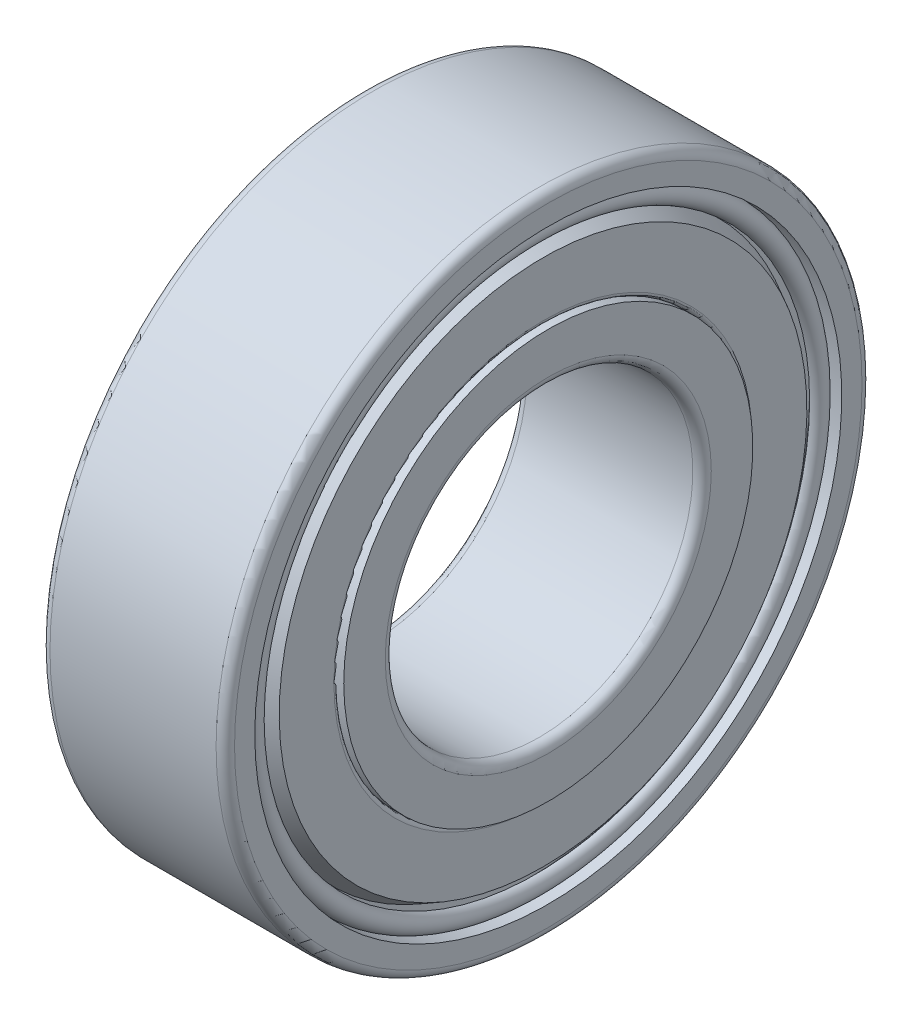
ISO-10303-21;
HEADER;
FILE_DESCRIPTION(('STEP AP214'),'2;1');
FILE_NAME('part.step','',(''),(''),'','','');
FILE_SCHEMA(('AUTOMOTIVE_DESIGN { 1 0 10303 214 1 1 1 1 }'));
ENDSEC;
DATA;
#1=APPLICATION_CONTEXT('core data for automotive mechanical design processes');
#2=APPLICATION_PROTOCOL_DEFINITION('international standard','automotive_design',2000,#1);
#3=PRODUCT_CONTEXT('',#1,'mechanical');
#4=PRODUCT('Part','Part','',(#3));
#5=PRODUCT_RELATED_PRODUCT_CATEGORY('part','',(#4));
#6=PRODUCT_DEFINITION_FORMATION('','',#4);
#7=PRODUCT_DEFINITION_CONTEXT('part definition',#1,'design');
#8=PRODUCT_DEFINITION('design','',#6,#7);
#9=PRODUCT_DEFINITION_SHAPE('','',#8);
#10=(LENGTH_UNIT() NAMED_UNIT(*) SI_UNIT(.MILLI.,.METRE.));
#11=(NAMED_UNIT(*) PLANE_ANGLE_UNIT() SI_UNIT($,.RADIAN.));
#12=(NAMED_UNIT(*) SI_UNIT($,.STERADIAN.) SOLID_ANGLE_UNIT());
#13=UNCERTAINTY_MEASURE_WITH_UNIT(LENGTH_MEASURE(1.E-05),#10,'distance_accuracy_value','');
#14=(GEOMETRIC_REPRESENTATION_CONTEXT(3) GLOBAL_UNCERTAINTY_ASSIGNED_CONTEXT((#13)) GLOBAL_UNIT_ASSIGNED_CONTEXT((#10,
#11,#12)) REPRESENTATION_CONTEXT('',''));
#15=CARTESIAN_POINT('',(0.,0.,0.));
#16=DIRECTION('',(0.,0.,1.));
#17=DIRECTION('',(1.,0.,0.));
#18=AXIS2_PLACEMENT_3D('',#15,#16,#17);
#19=CARTESIAN_POINT('',(10.36,0.,0.));
#20=DIRECTION('',(-1.,0.,0.));
#21=DIRECTION('',(0.,-1.,0.));
#22=AXIS2_PLACEMENT_3D('',#19,#20,#21);
#23=CONICAL_SURFACE('',#22,17.6352044884953,0.488692190558413);
#24=CARTESIAN_POINT('',(10.36,0.,0.));
#25=DIRECTION('',(-1.,0.,0.));
#26=DIRECTION('',(0.,-1.,0.));
#27=AXIS2_PLACEMENT_3D('',#24,#25,#26);
#28=CIRCLE('',#27,17.6352044884953);
#29=CARTESIAN_POINT('',(10.36,-17.6352044884953,0.));
#30=VERTEX_POINT('',#29);
#31=EDGE_CURVE('P0_E56',#30,#30,#28,.F.);
#32=ORIENTED_EDGE('',*,*,#31,.F.);
#33=EDGE_LOOP('',(#32));
#34=FACE_BOUND('',#33,.T.);
#35=CARTESIAN_POINT('',(11.46,0.,0.));
#36=DIRECTION('',(-1.,0.,0.));
#37=DIRECTION('',(0.,-1.,0.));
#38=AXIS2_PLACEMENT_3D('',#35,#36,#37);
#39=CIRCLE('',#38,17.0503241136677);
#40=CARTESIAN_POINT('',(11.46,-17.0503241136677,0.));
#41=VERTEX_POINT('',#40);
#42=EDGE_CURVE('P0_E53',#41,#41,#39,.T.);
#43=ORIENTED_EDGE('',*,*,#42,.F.);
#44=EDGE_LOOP('',(#43));
#45=FACE_BOUND('',#44,.T.);
#46=ADVANCED_FACE('P0_F15',(#34,#45),#23,.F.);
#47=CARTESIAN_POINT('',(10.36,0.,-18.0351017442477));
#48=DIRECTION('',(-1.,0.,0.));
#49=DIRECTION('',(0.,0.,1.));
#50=AXIS2_PLACEMENT_3D('',#47,#48,#49);
#51=PLANE('',#50);
#52=ORIENTED_EDGE('',*,*,#31,.T.);
#53=EDGE_LOOP('',(#52));
#54=FACE_BOUND('',#53,.T.);
#55=CARTESIAN_POINT('',(10.36,0.,0.));
#56=DIRECTION('',(-1.,0.,0.));
#57=DIRECTION('',(0.,-1.,0.));
#58=AXIS2_PLACEMENT_3D('',#55,#56,#57);
#59=CIRCLE('',#58,18.4349989999998);
#60=CARTESIAN_POINT('',(10.36,-18.4349989999998,0.));
#61=VERTEX_POINT('',#60);
#62=EDGE_CURVE('P0_E49',#61,#61,#59,.F.);
#63=ORIENTED_EDGE('',*,*,#62,.F.);
#64=EDGE_LOOP('',(#63));
#65=FACE_BOUND('',#64,.T.);
#66=ADVANCED_FACE('P0_F60',(#54,#65),#51,.T.);
#67=CARTESIAN_POINT('',(11.46,0.,-15.3251620568339));
#68=DIRECTION('',(-1.,0.,0.));
#69=DIRECTION('',(0.,-1.,0.));
#70=AXIS2_PLACEMENT_3D('',#67,#68,#69);
#71=PLANE('',#70);
#72=CARTESIAN_POINT('',(11.46,0.,0.));
#73=DIRECTION('',(-1.,0.,0.));
#74=DIRECTION('',(0.,0.,-1.));
#75=AXIS2_PLACEMENT_3D('',#72,#73,#74);
#76=CIRCLE('',#75,13.6);
#77=CARTESIAN_POINT('',(11.46,0.,-13.6));
#78=VERTEX_POINT('',#77);
#79=EDGE_CURVE('P0_E52',#78,#78,#76,.F.);
#80=ORIENTED_EDGE('',*,*,#79,.T.);
#81=EDGE_LOOP('',(#80));
#82=FACE_BOUND('',#81,.T.);
#83=ORIENTED_EDGE('',*,*,#42,.T.);
#84=EDGE_LOOP('',(#83));
#85=FACE_BOUND('',#84,.T.);
#86=ADVANCED_FACE('P0_F67',(#82,#85),#71,.T.);
#87=CARTESIAN_POINT('',(11.01,0.,0.));
#88=DIRECTION('',(-1.,0.,0.));
#89=DIRECTION('',(0.,1.,0.));
#90=AXIS2_PLACEMENT_3D('',#87,#88,#89);
#91=TOROIDAL_SURFACE('',#90,18.4042297692308,0.650727858295716);
#92=CARTESIAN_POINT('',(11.21,0.,0.));
#93=DIRECTION('',(-1.,0.,0.));
#94=DIRECTION('',(0.,0.,-1.));
#95=AXIS2_PLACEMENT_3D('',#92,#93,#94);
#96=CIRCLE('',#95,17.784999);
#97=CARTESIAN_POINT('',(11.21,0.,-17.784999));
#98=VERTEX_POINT('',#97);
#99=EDGE_CURVE('P0_E154',#98,#98,#96,.T.);
#100=ORIENTED_EDGE('',*,*,#99,.T.);
#101=EDGE_LOOP('',(#100));
#102=FACE_BOUND('',#101,.T.);
#103=ORIENTED_EDGE('',*,*,#62,.T.);
#104=EDGE_LOOP('',(#103));
#105=FACE_BOUND('',#104,.T.);
#106=ADVANCED_FACE('P0_F69',(#102,#105),#91,.T.);
#107=CARTESIAN_POINT('',(11.36,0.,0.));
#108=DIRECTION('',(-1.,0.,0.));
#109=DIRECTION('',(0.,1.,0.));
#110=AXIS2_PLACEMENT_3D('',#107,#108,#109);
#111=TOROIDAL_SURFACE('',#110,13.6,0.0999999999999996);
#112=ORIENTED_EDGE('',*,*,#79,.F.);
#113=EDGE_LOOP('',(#112));
#114=FACE_BOUND('',#113,.T.);
#115=CARTESIAN_POINT('',(11.36,0.,0.));
#116=DIRECTION('',(1.,0.,0.));
#117=DIRECTION('',(0.,1.,0.));
#118=AXIS2_PLACEMENT_3D('',#115,#116,#117);
#119=CIRCLE('',#118,13.5);
#120=CARTESIAN_POINT('',(11.36,13.5,0.));
#121=VERTEX_POINT('',#120);
#122=EDGE_CURVE('P0_E162',#121,#121,#119,.F.);
#123=ORIENTED_EDGE('',*,*,#122,.F.);
#124=EDGE_LOOP('',(#123));
#125=FACE_BOUND('',#124,.T.);
#126=ADVANCED_FACE('P0_F77',(#114,#125),#111,.F.);
#127=CARTESIAN_POINT('',(11.01,0.,0.));
#128=DIRECTION('',(-1.,0.,0.));
#129=DIRECTION('',(0.,-1.,0.));
#130=AXIS2_PLACEMENT_3D('',#127,#128,#129);
#131=CONICAL_SURFACE('',#130,17.984999,0.785398163397444);
#132=CARTESIAN_POINT('',(11.01,0.,0.));
#133=DIRECTION('',(-1.,0.,0.));
#134=DIRECTION('',(0.,1.,0.));
#135=AXIS2_PLACEMENT_3D('',#132,#133,#134);
#136=CIRCLE('',#135,17.984999);
#137=CARTESIAN_POINT('',(11.01,17.984999,0.));
#138=VERTEX_POINT('',#137);
#139=EDGE_CURVE('P0_E48',#138,#138,#136,.T.);
#140=ORIENTED_EDGE('',*,*,#139,.T.);
#141=EDGE_LOOP('',(#140));
#142=FACE_BOUND('',#141,.T.);
#143=ORIENTED_EDGE('',*,*,#99,.F.);
#144=EDGE_LOOP('',(#143));
#145=FACE_BOUND('',#144,.T.);
#146=ADVANCED_FACE('P0_F171',(#142,#145),#131,.F.);
#147=CARTESIAN_POINT('',(11.11,0.,0.));
#148=DIRECTION('',(1.,0.,0.));
#149=DIRECTION('',(0.,1.,0.));
#150=AXIS2_PLACEMENT_3D('',#147,#148,#149);
#151=CYLINDRICAL_SURFACE('',#150,13.5);
#152=ORIENTED_EDGE('',*,*,#122,.T.);
#153=EDGE_LOOP('',(#152));
#154=FACE_BOUND('',#153,.T.);
#155=CARTESIAN_POINT('',(10.86,0.,0.));
#156=DIRECTION('',(1.,0.,0.));
#157=DIRECTION('',(0.,1.,0.));
#158=AXIS2_PLACEMENT_3D('',#155,#156,#157);
#159=CIRCLE('',#158,13.5);
#160=CARTESIAN_POINT('',(10.86,13.5,0.));
#161=VERTEX_POINT('',#160);
#162=EDGE_CURVE('P0_E45',#161,#161,#159,.F.);
#163=ORIENTED_EDGE('',*,*,#162,.F.);
#164=EDGE_LOOP('',(#163));
#165=FACE_BOUND('',#164,.T.);
#166=ADVANCED_FACE('P0_F146',(#154,#165),#151,.T.);
#167=CARTESIAN_POINT('',(11.01,0.,0.));
#168=DIRECTION('',(-1.,0.,0.));
#169=DIRECTION('',(0.,1.,0.));
#170=AXIS2_PLACEMENT_3D('',#167,#168,#169);
#171=TOROIDAL_SURFACE('',#170,18.434999,0.449999999999997);
#172=CARTESIAN_POINT('',(10.56,0.,0.));
#173=DIRECTION('',(-1.,0.,0.));
#174=DIRECTION('',(0.,-1.,0.));
#175=AXIS2_PLACEMENT_3D('',#172,#173,#174);
#176=CIRCLE('',#175,18.434999);
#177=CARTESIAN_POINT('',(10.56,-18.434999,0.));
#178=VERTEX_POINT('',#177);
#179=EDGE_CURVE('P0_E44',#178,#178,#176,.F.);
#180=ORIENTED_EDGE('',*,*,#179,.F.);
#181=EDGE_LOOP('',(#180));
#182=FACE_BOUND('',#181,.T.);
#183=ORIENTED_EDGE('',*,*,#139,.F.);
#184=EDGE_LOOP('',(#183));
#185=FACE_BOUND('',#184,.T.);
#186=ADVANCED_FACE('P0_F141',(#182,#185),#171,.F.);
#187=CARTESIAN_POINT('',(10.86,0.,-13.4));
#188=DIRECTION('',(-1.,0.,0.));
#189=DIRECTION('',(0.,0.,1.));
#190=AXIS2_PLACEMENT_3D('',#187,#188,#189);
#191=PLANE('',#190);
#192=CARTESIAN_POINT('',(10.86,0.,0.));
#193=DIRECTION('',(1.,0.,0.));
#194=DIRECTION('',(0.,1.,0.));
#195=AXIS2_PLACEMENT_3D('',#192,#193,#194);
#196=CIRCLE('',#195,13.3);
#197=CARTESIAN_POINT('',(10.86,13.3,0.));
#198=VERTEX_POINT('',#197);
#199=EDGE_CURVE('P0_E41',#198,#198,#196,.T.);
#200=ORIENTED_EDGE('',*,*,#199,.T.);
#201=EDGE_LOOP('',(#200));
#202=FACE_BOUND('',#201,.T.);
#203=ORIENTED_EDGE('',*,*,#162,.T.);
#204=EDGE_LOOP('',(#203));
#205=FACE_BOUND('',#204,.T.);
#206=ADVANCED_FACE('P0_F137',(#202,#205),#191,.T.);
#207=CARTESIAN_POINT('',(10.56,0.,-18.0882726874138));
#208=DIRECTION('',(1.,0.,0.));
#209=DIRECTION('',(0.,1.,0.));
#210=AXIS2_PLACEMENT_3D('',#207,#208,#209);
#211=PLANE('',#210);
#212=CARTESIAN_POINT('',(10.56,0.,0.));
#213=DIRECTION('',(-1.,0.,0.));
#214=DIRECTION('',(0.,-1.,0.));
#215=AXIS2_PLACEMENT_3D('',#212,#213,#214);
#216=CIRCLE('',#215,17.7415463748276);
#217=CARTESIAN_POINT('',(10.56,-17.7415463748276,0.));
#218=VERTEX_POINT('',#217);
#219=EDGE_CURVE('P0_E32',#218,#218,#216,.F.);
#220=ORIENTED_EDGE('',*,*,#219,.F.);
#221=EDGE_LOOP('',(#220));
#222=FACE_BOUND('',#221,.T.);
#223=ORIENTED_EDGE('',*,*,#179,.T.);
#224=EDGE_LOOP('',(#223));
#225=FACE_BOUND('',#224,.T.);
#226=ADVANCED_FACE('P0_F126',(#222,#225),#211,.T.);
#227=CARTESIAN_POINT('',(11.11,0.,0.));
#228=DIRECTION('',(1.,0.,0.));
#229=DIRECTION('',(0.,1.,0.));
#230=AXIS2_PLACEMENT_3D('',#227,#228,#229);
#231=CYLINDRICAL_SURFACE('',#230,13.3);
#232=ORIENTED_EDGE('',*,*,#199,.F.);
#233=EDGE_LOOP('',(#232));
#234=FACE_BOUND('',#233,.T.);
#235=CARTESIAN_POINT('',(11.36,0.,0.));
#236=DIRECTION('',(-1.,0.,0.));
#237=DIRECTION('',(0.,1.,0.));
#238=AXIS2_PLACEMENT_3D('',#235,#236,#237);
#239=CIRCLE('',#238,13.3);
#240=CARTESIAN_POINT('',(11.36,13.3,0.));
#241=VERTEX_POINT('',#240);
#242=EDGE_CURVE('P0_E27',#241,#241,#239,.T.);
#243=ORIENTED_EDGE('',*,*,#242,.F.);
#244=EDGE_LOOP('',(#243));
#245=FACE_BOUND('',#244,.T.);
#246=ADVANCED_FACE('P0_F136',(#234,#245),#231,.F.);
#247=CARTESIAN_POINT('',(10.56,0.,0.));
#248=DIRECTION('',(-1.,0.,0.));
#249=DIRECTION('',(0.,-1.,0.));
#250=AXIS2_PLACEMENT_3D('',#247,#248,#249);
#251=CONICAL_SURFACE('',#250,17.7415463748276,0.488692190558412);
#252=CARTESIAN_POINT('',(11.66,0.,0.));
#253=DIRECTION('',(-1.,0.,0.));
#254=DIRECTION('',(0.,-1.,0.));
#255=AXIS2_PLACEMENT_3D('',#252,#253,#254);
#256=CIRCLE('',#255,17.156666);
#257=CARTESIAN_POINT('',(11.66,-17.156666,0.));
#258=VERTEX_POINT('',#257);
#259=EDGE_CURVE('P0_E22',#258,#258,#256,.F.);
#260=ORIENTED_EDGE('',*,*,#259,.F.);
#261=EDGE_LOOP('',(#260));
#262=FACE_BOUND('',#261,.T.);
#263=ORIENTED_EDGE('',*,*,#219,.T.);
#264=EDGE_LOOP('',(#263));
#265=FACE_BOUND('',#264,.T.);
#266=ADVANCED_FACE('P0_F89',(#262,#265),#251,.T.);
#267=CARTESIAN_POINT('',(11.36,0.,0.));
#268=DIRECTION('',(-1.,0.,0.));
#269=DIRECTION('',(0.,1.,0.));
#270=AXIS2_PLACEMENT_3D('',#267,#268,#269);
#271=TOROIDAL_SURFACE('',#270,13.6,0.299999999999999);
#272=ORIENTED_EDGE('',*,*,#242,.T.);
#273=EDGE_LOOP('',(#272));
#274=FACE_BOUND('',#273,.T.);
#275=CARTESIAN_POINT('',(11.66,0.,0.));
#276=DIRECTION('',(1.,0.,0.));
#277=DIRECTION('',(0.,0.,-1.));
#278=AXIS2_PLACEMENT_3D('',#275,#276,#277);
#279=CIRCLE('',#278,13.6);
#280=CARTESIAN_POINT('',(11.66,0.,-13.6));
#281=VERTEX_POINT('',#280);
#282=EDGE_CURVE('P0_E10',#281,#281,#279,.F.);
#283=ORIENTED_EDGE('',*,*,#282,.F.);
#284=EDGE_LOOP('',(#283));
#285=FACE_BOUND('',#284,.T.);
#286=ADVANCED_FACE('P0_F84',(#274,#285),#271,.T.);
#287=CARTESIAN_POINT('',(11.66,0.,-15.378333));
#288=DIRECTION('',(1.,0.,0.));
#289=DIRECTION('',(0.,0.,-1.));
#290=AXIS2_PLACEMENT_3D('',#287,#288,#289);
#291=PLANE('',#290);
#292=ORIENTED_EDGE('',*,*,#282,.T.);
#293=EDGE_LOOP('',(#292));
#294=FACE_BOUND('',#293,.T.);
#295=ORIENTED_EDGE('',*,*,#259,.T.);
#296=EDGE_LOOP('',(#295));
#297=FACE_BOUND('',#296,.T.);
#298=ADVANCED_FACE('P0_F82',(#294,#297),#291,.T.);
#299=CLOSED_SHELL('',(#46,#66,#86,#106,#126,#146,#166,#186,#206,#226,#246,#266,#286,#298));
#300=MANIFOLD_SOLID_BREP('P0_B1',#299);
#301=CARTESIAN_POINT('',(1.64,0.,0.));
#302=DIRECTION('',(1.,0.,0.));
#303=DIRECTION('',(0.,1.,0.));
#304=AXIS2_PLACEMENT_3D('',#301,#302,#303);
#305=CONICAL_SURFACE('',#304,17.6352044884953,0.488692190558413);
#306=CARTESIAN_POINT('',(1.64,0.,0.));
#307=DIRECTION('',(1.,0.,0.));
#308=DIRECTION('',(0.,1.,0.));
#309=AXIS2_PLACEMENT_3D('',#306,#307,#308);
#310=CIRCLE('',#309,17.6352044884953);
#311=CARTESIAN_POINT('',(1.64,17.6352044884953,0.));
#312=VERTEX_POINT('',#311);
#313=EDGE_CURVE('P1_E56',#312,#312,#310,.F.);
#314=ORIENTED_EDGE('',*,*,#313,.F.);
#315=EDGE_LOOP('',(#314));
#316=FACE_BOUND('',#315,.T.);
#317=CARTESIAN_POINT('',(0.540000000000006,0.,0.));
#318=DIRECTION('',(1.,0.,0.));
#319=DIRECTION('',(0.,1.,0.));
#320=AXIS2_PLACEMENT_3D('',#317,#318,#319);
#321=CIRCLE('',#320,17.0503241136677);
#322=CARTESIAN_POINT('',(0.540000000000006,17.0503241136677,0.));
#323=VERTEX_POINT('',#322);
#324=EDGE_CURVE('P1_E53',#323,#323,#321,.T.);
#325=ORIENTED_EDGE('',*,*,#324,.F.);
#326=EDGE_LOOP('',(#325));
#327=FACE_BOUND('',#326,.T.);
#328=ADVANCED_FACE('P1_F15',(#316,#327),#305,.F.);
#329=CARTESIAN_POINT('',(1.64,0.,18.0351017442477));
#330=DIRECTION('',(1.,0.,0.));
#331=DIRECTION('',(0.,0.,-1.));
#332=AXIS2_PLACEMENT_3D('',#329,#330,#331);
#333=PLANE('',#332);
#334=ORIENTED_EDGE('',*,*,#313,.T.);
#335=EDGE_LOOP('',(#334));
#336=FACE_BOUND('',#335,.T.);
#337=CARTESIAN_POINT('',(1.64,0.,0.));
#338=DIRECTION('',(1.,0.,0.));
#339=DIRECTION('',(0.,0.,-1.));
#340=AXIS2_PLACEMENT_3D('',#337,#338,#339);
#341=CIRCLE('',#340,18.434999);
#342=CARTESIAN_POINT('',(1.64,0.,-18.434999));
#343=VERTEX_POINT('',#342);
#344=EDGE_CURVE('P1_E49',#343,#343,#341,.F.);
#345=ORIENTED_EDGE('',*,*,#344,.F.);
#346=EDGE_LOOP('',(#345));
#347=FACE_BOUND('',#346,.T.);
#348=ADVANCED_FACE('P1_F60',(#336,#347),#333,.T.);
#349=CARTESIAN_POINT('',(0.54,0.,15.3251620568339));
#350=DIRECTION('',(1.,0.,0.));
#351=DIRECTION('',(0.,0.,-1.));
#352=AXIS2_PLACEMENT_3D('',#349,#350,#351);
#353=PLANE('',#352);
#354=CARTESIAN_POINT('',(0.54,0.,0.));
#355=DIRECTION('',(1.,0.,0.));
#356=DIRECTION('',(0.,0.,1.));
#357=AXIS2_PLACEMENT_3D('',#354,#355,#356);
#358=CIRCLE('',#357,13.6);
#359=CARTESIAN_POINT('',(0.54,0.,13.6));
#360=VERTEX_POINT('',#359);
#361=EDGE_CURVE('P1_E52',#360,#360,#358,.F.);
#362=ORIENTED_EDGE('',*,*,#361,.T.);
#363=EDGE_LOOP('',(#362));
#364=FACE_BOUND('',#363,.T.);
#365=ORIENTED_EDGE('',*,*,#324,.T.);
#366=EDGE_LOOP('',(#365));
#367=FACE_BOUND('',#366,.T.);
#368=ADVANCED_FACE('P1_F67',(#364,#367),#353,.T.);
#369=CARTESIAN_POINT('',(0.990000000000001,0.,0.));
#370=DIRECTION('',(1.,0.,0.));
#371=DIRECTION('',(0.,1.,0.));
#372=AXIS2_PLACEMENT_3D('',#369,#370,#371);
#373=TOROIDAL_SURFACE('',#372,18.4042297692308,0.650727858295716);
#374=CARTESIAN_POINT('',(0.789999999999999,0.,0.));
#375=DIRECTION('',(1.,0.,0.));
#376=DIRECTION('',(0.,0.,1.));
#377=AXIS2_PLACEMENT_3D('',#374,#375,#376);
#378=CIRCLE('',#377,17.784999);
#379=CARTESIAN_POINT('',(0.789999999999998,0.,17.784999));
#380=VERTEX_POINT('',#379);
#381=EDGE_CURVE('P1_E154',#380,#380,#378,.T.);
#382=ORIENTED_EDGE('',*,*,#381,.T.);
#383=EDGE_LOOP('',(#382));
#384=FACE_BOUND('',#383,.T.);
#385=ORIENTED_EDGE('',*,*,#344,.T.);
#386=EDGE_LOOP('',(#385));
#387=FACE_BOUND('',#386,.T.);
#388=ADVANCED_FACE('P1_F69',(#384,#387),#373,.T.);
#389=CARTESIAN_POINT('',(0.64,0.,0.));
#390=DIRECTION('',(1.,0.,0.));
#391=DIRECTION('',(0.,1.,0.));
#392=AXIS2_PLACEMENT_3D('',#389,#390,#391);
#393=TOROIDAL_SURFACE('',#392,13.6,0.0999999999999996);
#394=ORIENTED_EDGE('',*,*,#361,.F.);
#395=EDGE_LOOP('',(#394));
#396=FACE_BOUND('',#395,.T.);
#397=CARTESIAN_POINT('',(0.64,0.,0.));
#398=DIRECTION('',(-1.,0.,0.));
#399=DIRECTION('',(0.,0.,1.));
#400=AXIS2_PLACEMENT_3D('',#397,#398,#399);
#401=CIRCLE('',#400,13.5);
#402=CARTESIAN_POINT('',(0.64,0.,13.5));
#403=VERTEX_POINT('',#402);
#404=EDGE_CURVE('P1_E162',#403,#403,#401,.F.);
#405=ORIENTED_EDGE('',*,*,#404,.F.);
#406=EDGE_LOOP('',(#405));
#407=FACE_BOUND('',#406,.T.);
#408=ADVANCED_FACE('P1_F77',(#396,#407),#393,.F.);
#409=CARTESIAN_POINT('',(0.989999999999999,0.,0.));
#410=DIRECTION('',(1.,0.,0.));
#411=DIRECTION('',(0.,0.,-1.));
#412=AXIS2_PLACEMENT_3D('',#409,#410,#411);
#413=CONICAL_SURFACE('',#412,17.984999,0.785398163397449);
#414=CARTESIAN_POINT('',(0.99,0.,0.));
#415=DIRECTION('',(1.,0.,0.));
#416=DIRECTION('',(0.,1.,0.));
#417=AXIS2_PLACEMENT_3D('',#414,#415,#416);
#418=CIRCLE('',#417,17.984999);
#419=CARTESIAN_POINT('',(0.99,17.984999,0.));
#420=VERTEX_POINT('',#419);
#421=EDGE_CURVE('P1_E48',#420,#420,#418,.T.);
#422=ORIENTED_EDGE('',*,*,#421,.T.);
#423=EDGE_LOOP('',(#422));
#424=FACE_BOUND('',#423,.T.);
#425=ORIENTED_EDGE('',*,*,#381,.F.);
#426=EDGE_LOOP('',(#425));
#427=FACE_BOUND('',#426,.T.);
#428=ADVANCED_FACE('P1_F171',(#424,#427),#413,.F.);
#429=CARTESIAN_POINT('',(0.89,0.,0.));
#430=DIRECTION('',(-1.,0.,0.));
#431=DIRECTION('',(0.,0.,1.));
#432=AXIS2_PLACEMENT_3D('',#429,#430,#431);
#433=CYLINDRICAL_SURFACE('',#432,13.5);
#434=ORIENTED_EDGE('',*,*,#404,.T.);
#435=EDGE_LOOP('',(#434));
#436=FACE_BOUND('',#435,.T.);
#437=CARTESIAN_POINT('',(1.14,0.,0.));
#438=DIRECTION('',(-1.,0.,0.));
#439=DIRECTION('',(0.,0.,1.));
#440=AXIS2_PLACEMENT_3D('',#437,#438,#439);
#441=CIRCLE('',#440,13.5);
#442=CARTESIAN_POINT('',(1.14,0.,13.5));
#443=VERTEX_POINT('',#442);
#444=EDGE_CURVE('P1_E45',#443,#443,#441,.F.);
#445=ORIENTED_EDGE('',*,*,#444,.F.);
#446=EDGE_LOOP('',(#445));
#447=FACE_BOUND('',#446,.T.);
#448=ADVANCED_FACE('P1_F146',(#436,#447),#433,.T.);
#449=CARTESIAN_POINT('',(0.990000000000003,0.,0.));
#450=DIRECTION('',(1.,0.,0.));
#451=DIRECTION('',(0.,1.,0.));
#452=AXIS2_PLACEMENT_3D('',#449,#450,#451);
#453=TOROIDAL_SURFACE('',#452,18.434999,0.449999999999997);
#454=CARTESIAN_POINT('',(1.44,0.,0.));
#455=DIRECTION('',(1.,0.,0.));
#456=DIRECTION('',(0.,-1.,0.));
#457=AXIS2_PLACEMENT_3D('',#454,#455,#456);
#458=CIRCLE('',#457,18.434999);
#459=CARTESIAN_POINT('',(1.44,-18.434999,0.));
#460=VERTEX_POINT('',#459);
#461=EDGE_CURVE('P1_E44',#460,#460,#458,.F.);
#462=ORIENTED_EDGE('',*,*,#461,.F.);
#463=EDGE_LOOP('',(#462));
#464=FACE_BOUND('',#463,.T.);
#465=ORIENTED_EDGE('',*,*,#421,.F.);
#466=EDGE_LOOP('',(#465));
#467=FACE_BOUND('',#466,.T.);
#468=ADVANCED_FACE('P1_F141',(#464,#467),#453,.F.);
#469=CARTESIAN_POINT('',(1.14,0.,13.4));
#470=DIRECTION('',(1.,0.,0.));
#471=DIRECTION('',(0.,0.,-1.));
#472=AXIS2_PLACEMENT_3D('',#469,#470,#471);
#473=PLANE('',#472);
#474=CARTESIAN_POINT('',(1.14,0.,0.));
#475=DIRECTION('',(-1.,0.,0.));
#476=DIRECTION('',(0.,0.,1.));
#477=AXIS2_PLACEMENT_3D('',#474,#475,#476);
#478=CIRCLE('',#477,13.3);
#479=CARTESIAN_POINT('',(1.14,0.,13.3));
#480=VERTEX_POINT('',#479);
#481=EDGE_CURVE('P1_E41',#480,#480,#478,.T.);
#482=ORIENTED_EDGE('',*,*,#481,.T.);
#483=EDGE_LOOP('',(#482));
#484=FACE_BOUND('',#483,.T.);
#485=ORIENTED_EDGE('',*,*,#444,.T.);
#486=EDGE_LOOP('',(#485));
#487=FACE_BOUND('',#486,.T.);
#488=ADVANCED_FACE('P1_F137',(#484,#487),#473,.T.);
#489=CARTESIAN_POINT('',(1.44,0.,18.0882726874138));
#490=DIRECTION('',(-1.,0.,0.));
#491=DIRECTION('',(0.,0.,1.));
#492=AXIS2_PLACEMENT_3D('',#489,#490,#491);
#493=PLANE('',#492);
#494=CARTESIAN_POINT('',(1.43999999999999,0.,0.));
#495=DIRECTION('',(1.,0.,0.));
#496=DIRECTION('',(0.,0.,-1.));
#497=AXIS2_PLACEMENT_3D('',#494,#495,#496);
#498=CIRCLE('',#497,17.7415463748276);
#499=CARTESIAN_POINT('',(1.43999999999999,0.,-17.7415463748276));
#500=VERTEX_POINT('',#499);
#501=EDGE_CURVE('P1_E32',#500,#500,#498,.F.);
#502=ORIENTED_EDGE('',*,*,#501,.F.);
#503=EDGE_LOOP('',(#502));
#504=FACE_BOUND('',#503,.T.);
#505=ORIENTED_EDGE('',*,*,#461,.T.);
#506=EDGE_LOOP('',(#505));
#507=FACE_BOUND('',#506,.T.);
#508=ADVANCED_FACE('P1_F126',(#504,#507),#493,.T.);
#509=CARTESIAN_POINT('',(0.89,0.,0.));
#510=DIRECTION('',(-1.,0.,0.));
#511=DIRECTION('',(0.,0.,1.));
#512=AXIS2_PLACEMENT_3D('',#509,#510,#511);
#513=CYLINDRICAL_SURFACE('',#512,13.3);
#514=ORIENTED_EDGE('',*,*,#481,.F.);
#515=EDGE_LOOP('',(#514));
#516=FACE_BOUND('',#515,.T.);
#517=CARTESIAN_POINT('',(0.64,0.,0.));
#518=DIRECTION('',(1.,0.,0.));
#519=DIRECTION('',(0.,1.,0.));
#520=AXIS2_PLACEMENT_3D('',#517,#518,#519);
#521=CIRCLE('',#520,13.3);
#522=CARTESIAN_POINT('',(0.64,13.3,0.));
#523=VERTEX_POINT('',#522);
#524=EDGE_CURVE('P1_E27',#523,#523,#521,.T.);
#525=ORIENTED_EDGE('',*,*,#524,.F.);
#526=EDGE_LOOP('',(#525));
#527=FACE_BOUND('',#526,.T.);
#528=ADVANCED_FACE('P1_F136',(#516,#527),#513,.F.);
#529=CARTESIAN_POINT('',(1.43999999999999,0.,0.));
#530=DIRECTION('',(1.,0.,0.));
#531=DIRECTION('',(0.,0.,-1.));
#532=AXIS2_PLACEMENT_3D('',#529,#530,#531);
#533=CONICAL_SURFACE('',#532,17.7415463748276,0.488692190558413);
#534=CARTESIAN_POINT('',(0.340000000000007,0.,0.));
#535=DIRECTION('',(1.,0.,0.));
#536=DIRECTION('',(0.,0.,-1.));
#537=AXIS2_PLACEMENT_3D('',#534,#535,#536);
#538=CIRCLE('',#537,17.156666);
#539=CARTESIAN_POINT('',(0.340000000000007,0.,-17.156666));
#540=VERTEX_POINT('',#539);
#541=EDGE_CURVE('P1_E22',#540,#540,#538,.F.);
#542=ORIENTED_EDGE('',*,*,#541,.F.);
#543=EDGE_LOOP('',(#542));
#544=FACE_BOUND('',#543,.T.);
#545=ORIENTED_EDGE('',*,*,#501,.T.);
#546=EDGE_LOOP('',(#545));
#547=FACE_BOUND('',#546,.T.);
#548=ADVANCED_FACE('P1_F89',(#544,#547),#533,.T.);
#549=CARTESIAN_POINT('',(0.639999999999998,0.,0.));
#550=DIRECTION('',(1.,0.,0.));
#551=DIRECTION('',(0.,1.,0.));
#552=AXIS2_PLACEMENT_3D('',#549,#550,#551);
#553=TOROIDAL_SURFACE('',#552,13.6,0.299999999999999);
#554=ORIENTED_EDGE('',*,*,#524,.T.);
#555=EDGE_LOOP('',(#554));
#556=FACE_BOUND('',#555,.T.);
#557=CARTESIAN_POINT('',(0.339999999999999,0.,0.));
#558=DIRECTION('',(-1.,0.,0.));
#559=DIRECTION('',(0.,0.,1.));
#560=AXIS2_PLACEMENT_3D('',#557,#558,#559);
#561=CIRCLE('',#560,13.6);
#562=CARTESIAN_POINT('',(0.339999999999999,0.,13.6));
#563=VERTEX_POINT('',#562);
#564=EDGE_CURVE('P1_E10',#563,#563,#561,.F.);
#565=ORIENTED_EDGE('',*,*,#564,.F.);
#566=EDGE_LOOP('',(#565));
#567=FACE_BOUND('',#566,.T.);
#568=ADVANCED_FACE('P1_F84',(#556,#567),#553,.T.);
#569=CARTESIAN_POINT('',(0.34,0.,15.378333));
#570=DIRECTION('',(-1.,0.,0.));
#571=DIRECTION('',(0.,0.,1.));
#572=AXIS2_PLACEMENT_3D('',#569,#570,#571);
#573=PLANE('',#572);
#574=ORIENTED_EDGE('',*,*,#564,.T.);
#575=EDGE_LOOP('',(#574));
#576=FACE_BOUND('',#575,.T.);
#577=ORIENTED_EDGE('',*,*,#541,.T.);
#578=EDGE_LOOP('',(#577));
#579=FACE_BOUND('',#578,.T.);
#580=ADVANCED_FACE('P1_F82',(#576,#579),#573,.T.);
#581=CLOSED_SHELL('',(#328,#348,#368,#388,#408,#428,#448,#468,#488,#508,#528,#548,#568,#580));
#582=MANIFOLD_SOLID_BREP('P1_B1',#581);
#583=CARTESIAN_POINT('',(6.,11.9311422015781,-10.0114170208679));
#584=DIRECTION('',(0.57316594407899,0.804268306541565,0.156949965405551));
#585=DIRECTION('',(-0.610917125860704,0.291750056409459,0.735977017246581));
#586=AXIS2_PLACEMENT_3D('',#583,#584,#585);
#587=SPHERICAL_SURFACE('',#586,3.175);
#588=CARTESIAN_POINT('',(4.18019812754921,9.37759032830863,-10.5097331610305));
#589=VERTEX_POINT('',#588);
#590=VERTEX_LOOP('',#589);
#591=FACE_BOUND('',#590,.T.);
#592=CARTESIAN_POINT('',(7.81980187245079,14.4846940748476,-9.51310088070527));
#593=VERTEX_POINT('',#592);
#594=VERTEX_LOOP('',#593);
#595=FACE_BOUND('',#594,.T.);
#596=ADVANCED_FACE('P2_F16',(#591,#595),#587,.T.);
#597=CLOSED_SHELL('',(#596));
#598=MANIFOLD_SOLID_BREP('P2_B1',#597);
#599=CARTESIAN_POINT('',(6.,2.70457036716243,-15.3383807531651));
#600=DIRECTION('',(0.57316594407899,0.804268306541565,0.156949965405551));
#601=DIRECTION('',(-0.610917125860704,0.291750056409459,0.735977017246581));
#602=AXIS2_PLACEMENT_3D('',#599,#600,#601);
#603=SPHERICAL_SURFACE('',#602,3.175);
#604=CARTESIAN_POINT('',(4.18019812754921,0.151018493892962,-15.8366968933277));
#605=VERTEX_POINT('',#604);
#606=VERTEX_LOOP('',#605);
#607=FACE_BOUND('',#606,.T.);
#608=CARTESIAN_POINT('',(7.81980187245079,5.2581222404319,-14.8400646130025));
#609=VERTEX_POINT('',#608);
#610=VERTEX_LOOP('',#609);
#611=FACE_BOUND('',#610,.T.);
#612=ADVANCED_FACE('P3_F16',(#607,#611),#603,.T.);
#613=CLOSED_SHELL('',(#612));
#614=MANIFOLD_SOLID_BREP('P3_B1',#613);
#615=CARTESIAN_POINT('',(6.,-7.78750000000001,-13.4883456639426));
#616=DIRECTION('',(0.57316594407899,0.804268306541565,0.156949965405551));
#617=DIRECTION('',(-0.610917125860704,0.291750056409459,0.735977017246581));
#618=AXIS2_PLACEMENT_3D('',#615,#616,#617);
#619=SPHERICAL_SURFACE('',#618,3.175);
#620=CARTESIAN_POINT('',(4.18019812754921,-10.3410518732695,-13.9866618041052));
#621=VERTEX_POINT('',#620);
#622=VERTEX_LOOP('',#621);
#623=FACE_BOUND('',#622,.T.);
#624=CARTESIAN_POINT('',(7.81980187245079,-5.23394812673054,-12.99002952378));
#625=VERTEX_POINT('',#624);
#626=VERTEX_LOOP('',#625);
#627=FACE_BOUND('',#626,.T.);
#628=ADVANCED_FACE('P4_F16',(#623,#627),#619,.T.);
#629=CLOSED_SHELL('',(#628));
#630=MANIFOLD_SOLID_BREP('P4_B1',#629);
#631=CARTESIAN_POINT('',(6.,-14.6357125687405,-5.32696373229729));
#632=DIRECTION('',(0.57316594407899,0.804268306541565,0.156949965405551));
#633=DIRECTION('',(-0.610917125860704,0.291750056409459,0.735977017246581));
#634=AXIS2_PLACEMENT_3D('',#631,#632,#633);
#635=SPHERICAL_SURFACE('',#634,3.175);
#636=CARTESIAN_POINT('',(4.18019812754921,-17.18926444201,-5.82527987245991));
#637=VERTEX_POINT('',#636);
#638=VERTEX_LOOP('',#637);
#639=FACE_BOUND('',#638,.T.);
#640=CARTESIAN_POINT('',(7.81980187245079,-12.082160695471,-4.82864759213466));
#641=VERTEX_POINT('',#640);
#642=VERTEX_LOOP('',#641);
#643=FACE_BOUND('',#642,.T.);
#644=ADVANCED_FACE('P5_F16',(#639,#643),#635,.T.);
#645=CLOSED_SHELL('',(#644));
#646=MANIFOLD_SOLID_BREP('P5_B1',#645);
#647=CARTESIAN_POINT('',(6.,-14.6357125687405,5.32696373229729));
#648=DIRECTION('',(0.57316594407899,0.804268306541565,0.156949965405551));
#649=DIRECTION('',(-0.610917125860704,0.291750056409459,0.735977017246581));
#650=AXIS2_PLACEMENT_3D('',#647,#648,#649);
#651=SPHERICAL_SURFACE('',#650,3.175);
#652=CARTESIAN_POINT('',(7.81980187245079,-12.082160695471,5.82527987245992));
#653=VERTEX_POINT('',#652);
#654=VERTEX_LOOP('',#653);
#655=FACE_BOUND('',#654,.T.);
#656=CARTESIAN_POINT('',(4.18019812754921,-17.18926444201,4.82864759213466));
#657=VERTEX_POINT('',#656);
#658=VERTEX_LOOP('',#657);
#659=FACE_BOUND('',#658,.T.);
#660=ADVANCED_FACE('P6_F16',(#655,#659),#651,.T.);
#661=CLOSED_SHELL('',(#660));
#662=MANIFOLD_SOLID_BREP('P6_B1',#661);
#663=CARTESIAN_POINT('',(6.,-7.7875,13.4883456639426));
#664=DIRECTION('',(0.57316594407899,0.804268306541565,0.156949965405551));
#665=DIRECTION('',(-0.610917125860704,0.291750056409459,0.735977017246581));
#666=AXIS2_PLACEMENT_3D('',#663,#664,#665);
#667=SPHERICAL_SURFACE('',#666,3.175);
#668=CARTESIAN_POINT('',(7.81980187245079,-5.23394812673053,13.9866618041052));
#669=VERTEX_POINT('',#668);
#670=VERTEX_LOOP('',#669);
#671=FACE_BOUND('',#670,.T.);
#672=CARTESIAN_POINT('',(4.18019812754921,-10.3410518732695,12.99002952378));
#673=VERTEX_POINT('',#672);
#674=VERTEX_LOOP('',#673);
#675=FACE_BOUND('',#674,.T.);
#676=ADVANCED_FACE('P7_F16',(#671,#675),#667,.T.);
#677=CLOSED_SHELL('',(#676));
#678=MANIFOLD_SOLID_BREP('P7_B1',#677);
#679=CARTESIAN_POINT('',(6.,2.70457036716244,15.3383807531651));
#680=DIRECTION('',(0.57316594407899,0.804268306541565,0.156949965405551));
#681=DIRECTION('',(-0.610917125860704,0.291750056409459,0.735977017246581));
#682=AXIS2_PLACEMENT_3D('',#679,#680,#681);
#683=SPHERICAL_SURFACE('',#682,3.175);
#684=CARTESIAN_POINT('',(7.81980187245079,5.25812224043191,15.8366968933277));
#685=VERTEX_POINT('',#684);
#686=VERTEX_LOOP('',#685);
#687=FACE_BOUND('',#686,.T.);
#688=CARTESIAN_POINT('',(4.18019812754921,0.151018493892972,14.8400646130025));
#689=VERTEX_POINT('',#688);
#690=VERTEX_LOOP('',#689);
#691=FACE_BOUND('',#690,.T.);
#692=ADVANCED_FACE('P8_F16',(#687,#691),#683,.T.);
#693=CLOSED_SHELL('',(#692));
#694=MANIFOLD_SOLID_BREP('P8_B1',#693);
#695=CARTESIAN_POINT('',(6.,11.9311422015781,10.0114170208678));
#696=DIRECTION('',(0.59642475200704,0.504719422071691,0.624128047901198));
#697=DIRECTION('',(-0.283089198035408,-0.595332836908352,0.751956992955264));
#698=AXIS2_PLACEMENT_3D('',#695,#696,#697);
#699=SPHERICAL_SURFACE('',#698,3.175);
#700=CARTESIAN_POINT('',(7.89364858762235,13.5336263666557,11.9930235729541));
#701=VERTEX_POINT('',#700);
#702=VERTEX_LOOP('',#701);
#703=FACE_BOUND('',#702,.T.);
#704=CARTESIAN_POINT('',(4.10635141237765,10.3286580365005,8.0298104687815));
#705=VERTEX_POINT('',#704);
#706=VERTEX_LOOP('',#705);
#707=FACE_BOUND('',#706,.T.);
#708=ADVANCED_FACE('P9_F16',(#703,#707),#699,.T.);
#709=CLOSED_SHELL('',(#708));
#710=MANIFOLD_SOLID_BREP('P9_B1',#709);
#711=CARTESIAN_POINT('',(6.,15.575,0.));
#712=DIRECTION('',(0.59642475200704,0.504719422071691,0.624128047901198));
#713=DIRECTION('',(-0.283089198035408,-0.595332836908352,0.751956992955264));
#714=AXIS2_PLACEMENT_3D('',#711,#712,#713);
#715=SPHERICAL_SURFACE('',#714,3.175);
#716=CARTESIAN_POINT('',(4.10635141237765,13.9725158349224,-1.9816065520863));
#717=VERTEX_POINT('',#716);
#718=VERTEX_LOOP('',#717);
#719=FACE_BOUND('',#718,.T.);
#720=CARTESIAN_POINT('',(7.89364858762235,17.1774841650776,1.9816065520863));
#721=VERTEX_POINT('',#720);
#722=VERTEX_LOOP('',#721);
#723=FACE_BOUND('',#722,.T.);
#724=ADVANCED_FACE('P10_F16',(#719,#723),#715,.T.);
#725=CLOSED_SHELL('',(#724));
#726=MANIFOLD_SOLID_BREP('P10_B1',#725);
#727=CARTESIAN_POINT('',(6.,0.,0.));
#728=DIRECTION('',(1.,0.,0.));
#729=DIRECTION('',(0.,1.,0.));
#730=AXIS2_PLACEMENT_3D('',#727,#728,#729);
#731=TOROIDAL_SURFACE('',#730,15.5,3.175);
#732=CARTESIAN_POINT('',(8.2550826514786,0.,0.));
#733=DIRECTION('',(-1.,0.,0.));
#734=DIRECTION('',(0.,0.,1.));
#735=AXIS2_PLACEMENT_3D('',#732,#733,#734);
#736=CIRCLE('',#735,17.7350005);
#737=CARTESIAN_POINT('',(8.2550826514786,0.,17.7350005));
#738=VERTEX_POINT('',#737);
#739=EDGE_CURVE('P11_E140',#738,#738,#736,.F.);
#740=ORIENTED_EDGE('',*,*,#739,.T.);
#741=EDGE_LOOP('',(#740));
#742=FACE_BOUND('',#741,.T.);
#743=CARTESIAN_POINT('',(3.7449173485214,0.,0.));
#744=DIRECTION('',(-1.,0.,0.));
#745=DIRECTION('',(0.,0.,1.));
#746=AXIS2_PLACEMENT_3D('',#743,#744,#745);
#747=CIRCLE('',#746,17.7350005);
#748=CARTESIAN_POINT('',(3.7449173485214,0.,17.7350005));
#749=VERTEX_POINT('',#748);
#750=EDGE_CURVE('P11_E130',#749,#749,#747,.T.);
#751=ORIENTED_EDGE('',*,*,#750,.T.);
#752=EDGE_LOOP('',(#751));
#753=FACE_BOUND('',#752,.T.);
#754=ADVANCED_FACE('P11_F15',(#742,#753),#731,.F.);
#755=CARTESIAN_POINT('',(2.6924586742607,0.,0.));
#756=DIRECTION('',(-1.,0.,0.));
#757=DIRECTION('',(0.,0.,1.));
#758=AXIS2_PLACEMENT_3D('',#755,#756,#757);
#759=CYLINDRICAL_SURFACE('',#758,17.7350005);
#760=ORIENTED_EDGE('',*,*,#750,.F.);
#761=EDGE_LOOP('',(#760));
#762=FACE_BOUND('',#761,.T.);
#763=CARTESIAN_POINT('',(1.64,0.,0.));
#764=DIRECTION('',(-1.,0.,0.));
#765=DIRECTION('',(0.,0.,1.));
#766=AXIS2_PLACEMENT_3D('',#763,#764,#765);
#767=CIRCLE('',#766,17.7350005);
#768=CARTESIAN_POINT('',(1.64,0.,17.7350005));
#769=VERTEX_POINT('',#768);
#770=EDGE_CURVE('P11_E19',#769,#769,#767,.F.);
#771=ORIENTED_EDGE('',*,*,#770,.F.);
#772=EDGE_LOOP('',(#771));
#773=FACE_BOUND('',#772,.T.);
#774=ADVANCED_FACE('P11_F98',(#762,#773),#759,.F.);
#775=CARTESIAN_POINT('',(9.3075413257393,0.,0.));
#776=DIRECTION('',(-1.,0.,0.));
#777=DIRECTION('',(0.,0.,1.));
#778=AXIS2_PLACEMENT_3D('',#775,#776,#777);
#779=CYLINDRICAL_SURFACE('',#778,17.7350005);
#780=CARTESIAN_POINT('',(10.36,0.,0.));
#781=DIRECTION('',(-1.,0.,0.));
#782=DIRECTION('',(0.,0.,1.));
#783=AXIS2_PLACEMENT_3D('',#780,#781,#782);
#784=CIRCLE('',#783,17.7350005);
#785=CARTESIAN_POINT('',(10.36,0.,17.7350005));
#786=VERTEX_POINT('',#785);
#787=EDGE_CURVE('P11_E136',#786,#786,#784,.T.);
#788=ORIENTED_EDGE('',*,*,#787,.F.);
#789=EDGE_LOOP('',(#788));
#790=FACE_BOUND('',#789,.T.);
#791=ORIENTED_EDGE('',*,*,#739,.F.);
#792=EDGE_LOOP('',(#791));
#793=FACE_BOUND('',#792,.T.);
#794=ADVANCED_FACE('P11_F95',(#790,#793),#779,.F.);
#795=CARTESIAN_POINT('',(1.64,0.,18.40999975));
#796=DIRECTION('',(-1.,0.,0.));
#797=DIRECTION('',(0.,0.,1.));
#798=AXIS2_PLACEMENT_3D('',#795,#796,#797);
#799=PLANE('',#798);
#800=ORIENTED_EDGE('',*,*,#770,.T.);
#801=EDGE_LOOP('',(#800));
#802=FACE_BOUND('',#801,.T.);
#803=CARTESIAN_POINT('',(1.64,0.,0.));
#804=DIRECTION('',(-1.,0.,0.));
#805=DIRECTION('',(0.,0.,1.));
#806=AXIS2_PLACEMENT_3D('',#803,#804,#805);
#807=CIRCLE('',#806,19.084999);
#808=CARTESIAN_POINT('',(1.64,0.,19.084999));
#809=VERTEX_POINT('',#808);
#810=EDGE_CURVE('P11_E134',#809,#809,#807,.T.);
#811=ORIENTED_EDGE('',*,*,#810,.T.);
#812=EDGE_LOOP('',(#811));
#813=FACE_BOUND('',#812,.T.);
#814=ADVANCED_FACE('P11_F91',(#802,#813),#799,.T.);
#815=CARTESIAN_POINT('',(10.36,0.,18.40999975));
#816=DIRECTION('',(1.,0.,0.));
#817=DIRECTION('',(0.,0.,-1.));
#818=AXIS2_PLACEMENT_3D('',#815,#816,#817);
#819=PLANE('',#818);
#820=ORIENTED_EDGE('',*,*,#787,.T.);
#821=EDGE_LOOP('',(#820));
#822=FACE_BOUND('',#821,.T.);
#823=CARTESIAN_POINT('',(10.36,0.,0.));
#824=DIRECTION('',(-1.,0.,0.));
#825=DIRECTION('',(0.,0.,1.));
#826=AXIS2_PLACEMENT_3D('',#823,#824,#825);
#827=CIRCLE('',#826,19.084999);
#828=CARTESIAN_POINT('',(10.36,0.,19.084999));
#829=VERTEX_POINT('',#828);
#830=EDGE_CURVE('P11_E127',#829,#829,#827,.F.);
#831=ORIENTED_EDGE('',*,*,#830,.T.);
#832=EDGE_LOOP('',(#831));
#833=FACE_BOUND('',#832,.T.);
#834=ADVANCED_FACE('P11_F87',(#822,#833),#819,.T.);
#835=CARTESIAN_POINT('',(0.82,0.,0.));
#836=DIRECTION('',(-1.,0.,0.));
#837=DIRECTION('',(0.,0.,1.));
#838=AXIS2_PLACEMENT_3D('',#835,#836,#837);
#839=CYLINDRICAL_SURFACE('',#838,19.084999);
#840=ORIENTED_EDGE('',*,*,#810,.F.);
#841=EDGE_LOOP('',(#840));
#842=FACE_BOUND('',#841,.T.);
#843=CARTESIAN_POINT('',(0.,0.,0.));
#844=DIRECTION('',(-1.,0.,0.));
#845=DIRECTION('',(0.,0.,1.));
#846=AXIS2_PLACEMENT_3D('',#843,#844,#845);
#847=CIRCLE('',#846,19.084999);
#848=CARTESIAN_POINT('',(0.,0.,19.084999));
#849=VERTEX_POINT('',#848);
#850=EDGE_CURVE('P11_E123',#849,#849,#847,.F.);
#851=ORIENTED_EDGE('',*,*,#850,.F.);
#852=EDGE_LOOP('',(#851));
#853=FACE_BOUND('',#852,.T.);
#854=ADVANCED_FACE('P11_F83',(#842,#853),#839,.F.);
#855=CARTESIAN_POINT('',(11.18,0.,0.));
#856=DIRECTION('',(-1.,0.,0.));
#857=DIRECTION('',(0.,0.,1.));
#858=AXIS2_PLACEMENT_3D('',#855,#856,#857);
#859=CYLINDRICAL_SURFACE('',#858,19.084999);
#860=CARTESIAN_POINT('',(12.,0.,0.));
#861=DIRECTION('',(-1.,0.,0.));
#862=DIRECTION('',(0.,0.,1.));
#863=AXIS2_PLACEMENT_3D('',#860,#861,#862);
#864=CIRCLE('',#863,19.084999);
#865=CARTESIAN_POINT('',(12.,0.,19.084999));
#866=VERTEX_POINT('',#865);
#867=EDGE_CURVE('P11_E121',#866,#866,#864,.T.);
#868=ORIENTED_EDGE('',*,*,#867,.F.);
#869=EDGE_LOOP('',(#868));
#870=FACE_BOUND('',#869,.T.);
#871=ORIENTED_EDGE('',*,*,#830,.F.);
#872=EDGE_LOOP('',(#871));
#873=FACE_BOUND('',#872,.T.);
#874=ADVANCED_FACE('P11_F78',(#870,#873),#859,.F.);
#875=CARTESIAN_POINT('',(0.,0.,19.7424995));
#876=DIRECTION('',(-1.,0.,0.));
#877=DIRECTION('',(0.,0.,1.));
#878=AXIS2_PLACEMENT_3D('',#875,#876,#877);
#879=PLANE('',#878);
#880=ORIENTED_EDGE('',*,*,#850,.T.);
#881=EDGE_LOOP('',(#880));
#882=FACE_BOUND('',#881,.T.);
#883=CARTESIAN_POINT('',(0.,0.,0.));
#884=DIRECTION('',(1.,0.,0.));
#885=DIRECTION('',(0.,-1.,0.));
#886=AXIS2_PLACEMENT_3D('',#883,#884,#885);
#887=CIRCLE('',#886,20.4);
#888=CARTESIAN_POINT('',(0.,-20.4,0.));
#889=VERTEX_POINT('',#888);
#890=EDGE_CURVE('P11_E62',#889,#889,#887,.T.);
#891=ORIENTED_EDGE('',*,*,#890,.F.);
#892=EDGE_LOOP('',(#891));
#893=FACE_BOUND('',#892,.T.);
#894=ADVANCED_FACE('P11_F68',(#882,#893),#879,.T.);
#895=CARTESIAN_POINT('',(12.,0.,19.7424995));
#896=DIRECTION('',(1.,0.,0.));
#897=DIRECTION('',(0.,0.,-1.));
#898=AXIS2_PLACEMENT_3D('',#895,#896,#897);
#899=PLANE('',#898);
#900=ORIENTED_EDGE('',*,*,#867,.T.);
#901=EDGE_LOOP('',(#900));
#902=FACE_BOUND('',#901,.T.);
#903=CARTESIAN_POINT('',(12.,0.,0.));
#904=DIRECTION('',(-1.,0.,0.));
#905=DIRECTION('',(0.,-1.,0.));
#906=AXIS2_PLACEMENT_3D('',#903,#904,#905);
#907=CIRCLE('',#906,20.4);
#908=CARTESIAN_POINT('',(12.,-20.4,0.));
#909=VERTEX_POINT('',#908);
#910=EDGE_CURVE('P11_E28',#909,#909,#907,.T.);
#911=ORIENTED_EDGE('',*,*,#910,.F.);
#912=EDGE_LOOP('',(#911));
#913=FACE_BOUND('',#912,.T.);
#914=ADVANCED_FACE('P11_F77',(#902,#913),#899,.T.);
#915=CARTESIAN_POINT('',(0.599999999999998,0.,0.));
#916=DIRECTION('',(1.,0.,0.));
#917=DIRECTION('',(0.,1.,0.));
#918=AXIS2_PLACEMENT_3D('',#915,#916,#917);
#919=TOROIDAL_SURFACE('',#918,20.4,0.599999999999998);
#920=ORIENTED_EDGE('',*,*,#890,.T.);
#921=EDGE_LOOP('',(#920));
#922=FACE_BOUND('',#921,.T.);
#923=CARTESIAN_POINT('',(0.6,0.,0.));
#924=DIRECTION('',(-1.,0.,0.));
#925=DIRECTION('',(0.,0.,1.));
#926=AXIS2_PLACEMENT_3D('',#923,#924,#925);
#927=CIRCLE('',#926,21.);
#928=CARTESIAN_POINT('',(0.6,0.,21.));
#929=VERTEX_POINT('',#928);
#930=EDGE_CURVE('P11_E23',#929,#929,#927,.F.);
#931=ORIENTED_EDGE('',*,*,#930,.F.);
#932=EDGE_LOOP('',(#931));
#933=FACE_BOUND('',#932,.T.);
#934=ADVANCED_FACE('P11_F42',(#922,#933),#919,.T.);
#935=CARTESIAN_POINT('',(11.4,0.,0.));
#936=DIRECTION('',(1.,0.,0.));
#937=DIRECTION('',(0.,1.,0.));
#938=AXIS2_PLACEMENT_3D('',#935,#936,#937);
#939=TOROIDAL_SURFACE('',#938,20.4,0.600000000000001);
#940=CARTESIAN_POINT('',(11.4,0.,0.));
#941=DIRECTION('',(-1.,0.,0.));
#942=DIRECTION('',(0.,0.,1.));
#943=AXIS2_PLACEMENT_3D('',#940,#941,#942);
#944=CIRCLE('',#943,21.);
#945=CARTESIAN_POINT('',(11.4,0.,21.));
#946=VERTEX_POINT('',#945);
#947=EDGE_CURVE('P11_E10',#946,#946,#944,.T.);
#948=ORIENTED_EDGE('',*,*,#947,.F.);
#949=EDGE_LOOP('',(#948));
#950=FACE_BOUND('',#949,.T.);
#951=ORIENTED_EDGE('',*,*,#910,.T.);
#952=EDGE_LOOP('',(#951));
#953=FACE_BOUND('',#952,.T.);
#954=ADVANCED_FACE('P11_F36',(#950,#953),#939,.T.);
#955=CARTESIAN_POINT('',(6.,0.,0.));
#956=DIRECTION('',(-1.,0.,0.));
#957=DIRECTION('',(0.,0.,1.));
#958=AXIS2_PLACEMENT_3D('',#955,#956,#957);
#959=CYLINDRICAL_SURFACE('',#958,21.);
#960=ORIENTED_EDGE('',*,*,#930,.T.);
#961=EDGE_LOOP('',(#960));
#962=FACE_BOUND('',#961,.T.);
#963=ORIENTED_EDGE('',*,*,#947,.T.);
#964=EDGE_LOOP('',(#963));
#965=FACE_BOUND('',#964,.T.);
#966=ADVANCED_FACE('P11_F41',(#962,#965),#959,.T.);
#967=CLOSED_SHELL('',(#754,#774,#794,#814,#834,#854,#874,#894,#914,#934,#954,#966));
#968=MANIFOLD_SOLID_BREP('P11_B1',#967);
#969=CARTESIAN_POINT('',(6.,0.,0.));
#970=DIRECTION('',(-1.,0.,0.));
#971=DIRECTION('',(0.,0.,1.));
#972=AXIS2_PLACEMENT_3D('',#969,#970,#971);
#973=CYLINDRICAL_SURFACE('',#972,10.);
#974=CARTESIAN_POINT('',(0.6,0.,0.));
#975=DIRECTION('',(1.,0.,0.));
#976=DIRECTION('',(0.,1.,0.));
#977=AXIS2_PLACEMENT_3D('',#974,#975,#976);
#978=CIRCLE('',#977,10.);
#979=CARTESIAN_POINT('',(0.6,10.,0.));
#980=VERTEX_POINT('',#979);
#981=EDGE_CURVE('P12_E69',#980,#980,#978,.T.);
#982=ORIENTED_EDGE('',*,*,#981,.F.);
#983=EDGE_LOOP('',(#982));
#984=FACE_BOUND('',#983,.T.);
#985=CARTESIAN_POINT('',(11.4,0.,0.));
#986=DIRECTION('',(1.,0.,0.));
#987=DIRECTION('',(0.,1.,0.));
#988=AXIS2_PLACEMENT_3D('',#985,#986,#987);
#989=CIRCLE('',#988,10.);
#990=CARTESIAN_POINT('',(11.4,10.,0.));
#991=VERTEX_POINT('',#990);
#992=EDGE_CURVE('P12_E66',#991,#991,#989,.F.);
#993=ORIENTED_EDGE('',*,*,#992,.F.);
#994=EDGE_LOOP('',(#993));
#995=FACE_BOUND('',#994,.T.);
#996=ADVANCED_FACE('P12_F15',(#984,#995),#973,.F.);
#997=CARTESIAN_POINT('',(0.6,0.,0.));
#998=DIRECTION('',(1.,0.,0.));
#999=DIRECTION('',(0.,1.,0.));
#1000=AXIS2_PLACEMENT_3D('',#997,#998,#999);
#1001=TOROIDAL_SURFACE('',#1000,10.6,0.6);
#1002=ORIENTED_EDGE('',*,*,#981,.T.);
#1003=EDGE_LOOP('',(#1002));
#1004=FACE_BOUND('',#1003,.T.);
#1005=CARTESIAN_POINT('',(0.,0.,0.));
#1006=DIRECTION('',(-1.,0.,0.));
#1007=DIRECTION('',(0.,-1.,0.));
#1008=AXIS2_PLACEMENT_3D('',#1005,#1006,#1007);
#1009=CIRCLE('',#1008,10.6);
#1010=CARTESIAN_POINT('',(0.,-10.6,0.));
#1011=VERTEX_POINT('',#1010);
#1012=EDGE_CURVE('P12_E39',#1011,#1011,#1009,.F.);
#1013=ORIENTED_EDGE('',*,*,#1012,.F.);
#1014=EDGE_LOOP('',(#1013));
#1015=FACE_BOUND('',#1014,.T.);
#1016=ADVANCED_FACE('P12_F59',(#1004,#1015),#1001,.T.);
#1017=CARTESIAN_POINT('',(11.4,0.,0.));
#1018=DIRECTION('',(1.,0.,0.));
#1019=DIRECTION('',(0.,1.,0.));
#1020=AXIS2_PLACEMENT_3D('',#1017,#1018,#1019);
#1021=TOROIDAL_SURFACE('',#1020,10.6,0.600000000000001);
#1022=CARTESIAN_POINT('',(12.,0.,0.));
#1023=DIRECTION('',(1.,0.,0.));
#1024=DIRECTION('',(0.,-1.,0.));
#1025=AXIS2_PLACEMENT_3D('',#1022,#1023,#1024);
#1026=CIRCLE('',#1025,10.6);
#1027=CARTESIAN_POINT('',(12.,-10.6,0.));
#1028=VERTEX_POINT('',#1027);
#1029=EDGE_CURVE('P12_E72',#1028,#1028,#1026,.F.);
#1030=ORIENTED_EDGE('',*,*,#1029,.F.);
#1031=EDGE_LOOP('',(#1030));
#1032=FACE_BOUND('',#1031,.T.);
#1033=ORIENTED_EDGE('',*,*,#992,.T.);
#1034=EDGE_LOOP('',(#1033));
#1035=FACE_BOUND('',#1034,.T.);
#1036=ADVANCED_FACE('P12_F54',(#1032,#1035),#1021,.T.);
#1037=CARTESIAN_POINT('',(0.,0.,11.95));
#1038=DIRECTION('',(-1.,0.,0.));
#1039=DIRECTION('',(0.,0.,1.));
#1040=AXIS2_PLACEMENT_3D('',#1037,#1038,#1039);
#1041=PLANE('',#1040);
#1042=ORIENTED_EDGE('',*,*,#1012,.T.);
#1043=EDGE_LOOP('',(#1042));
#1044=FACE_BOUND('',#1043,.T.);
#1045=CARTESIAN_POINT('',(0.,0.,0.));
#1046=DIRECTION('',(-1.,0.,0.));
#1047=DIRECTION('',(0.,0.,1.));
#1048=AXIS2_PLACEMENT_3D('',#1045,#1046,#1047);
#1049=CIRCLE('',#1048,13.3);
#1050=CARTESIAN_POINT('',(0.,0.,13.3));
#1051=VERTEX_POINT('',#1050);
#1052=EDGE_CURVE('P12_E18',#1051,#1051,#1049,.F.);
#1053=ORIENTED_EDGE('',*,*,#1052,.F.);
#1054=EDGE_LOOP('',(#1053));
#1055=FACE_BOUND('',#1054,.T.);
#1056=ADVANCED_FACE('P12_F44',(#1044,#1055),#1041,.T.);
#1057=CARTESIAN_POINT('',(12.,0.,11.95));
#1058=DIRECTION('',(1.,0.,0.));
#1059=DIRECTION('',(0.,0.,-1.));
#1060=AXIS2_PLACEMENT_3D('',#1057,#1058,#1059);
#1061=PLANE('',#1060);
#1062=ORIENTED_EDGE('',*,*,#1029,.T.);
#1063=EDGE_LOOP('',(#1062));
#1064=FACE_BOUND('',#1063,.T.);
#1065=CARTESIAN_POINT('',(12.,0.,0.));
#1066=DIRECTION('',(-1.,0.,0.));
#1067=DIRECTION('',(0.,0.,1.));
#1068=AXIS2_PLACEMENT_3D('',#1065,#1066,#1067);
#1069=CIRCLE('',#1068,13.3);
#1070=CARTESIAN_POINT('',(12.,0.,13.3));
#1071=VERTEX_POINT('',#1070);
#1072=EDGE_CURVE('P12_E27',#1071,#1071,#1069,.T.);
#1073=ORIENTED_EDGE('',*,*,#1072,.F.);
#1074=EDGE_LOOP('',(#1073));
#1075=FACE_BOUND('',#1074,.T.);
#1076=ADVANCED_FACE('P12_F53',(#1064,#1075),#1061,.T.);
#1077=CARTESIAN_POINT('',(1.85537942967986,0.,0.));
#1078=DIRECTION('',(-1.,0.,0.));
#1079=DIRECTION('',(0.,0.,1.));
#1080=AXIS2_PLACEMENT_3D('',#1077,#1078,#1079);
#1081=CYLINDRICAL_SURFACE('',#1080,13.3);
#1082=ORIENTED_EDGE('',*,*,#1052,.T.);
#1083=EDGE_LOOP('',(#1082));
#1084=FACE_BOUND('',#1083,.T.);
#1085=CARTESIAN_POINT('',(3.71075885935972,0.,0.));
#1086=DIRECTION('',(1.,0.,0.));
#1087=DIRECTION('',(0.,1.,0.));
#1088=AXIS2_PLACEMENT_3D('',#1085,#1086,#1087);
#1089=CIRCLE('',#1088,13.3);
#1090=CARTESIAN_POINT('',(3.71075885935972,13.3,0.));
#1091=VERTEX_POINT('',#1090);
#1092=EDGE_CURVE('P12_E22',#1091,#1091,#1089,.F.);
#1093=ORIENTED_EDGE('',*,*,#1092,.T.);
#1094=EDGE_LOOP('',(#1093));
#1095=FACE_BOUND('',#1094,.T.);
#1096=ADVANCED_FACE('P12_F110',(#1084,#1095),#1081,.T.);
#1097=CARTESIAN_POINT('',(10.1446205703201,0.,0.));
#1098=DIRECTION('',(-1.,0.,0.));
#1099=DIRECTION('',(0.,0.,1.));
#1100=AXIS2_PLACEMENT_3D('',#1097,#1098,#1099);
#1101=CYLINDRICAL_SURFACE('',#1100,13.3);
#1102=ORIENTED_EDGE('',*,*,#1072,.T.);
#1103=EDGE_LOOP('',(#1102));
#1104=FACE_BOUND('',#1103,.T.);
#1105=CARTESIAN_POINT('',(8.28924114064028,0.,0.));
#1106=DIRECTION('',(1.,0.,0.));
#1107=DIRECTION('',(0.,1.,0.));
#1108=AXIS2_PLACEMENT_3D('',#1105,#1106,#1107);
#1109=CIRCLE('',#1108,13.3);
#1110=CARTESIAN_POINT('',(8.28924114064028,13.3,0.));
#1111=VERTEX_POINT('',#1110);
#1112=EDGE_CURVE('P12_E10',#1111,#1111,#1109,.T.);
#1113=ORIENTED_EDGE('',*,*,#1112,.T.);
#1114=EDGE_LOOP('',(#1113));
#1115=FACE_BOUND('',#1114,.T.);
#1116=ADVANCED_FACE('P12_F107',(#1104,#1115),#1101,.T.);
#1117=CARTESIAN_POINT('',(6.,0.,0.));
#1118=DIRECTION('',(1.,0.,0.));
#1119=DIRECTION('',(0.,1.,0.));
#1120=AXIS2_PLACEMENT_3D('',#1117,#1118,#1119);
#1121=TOROIDAL_SURFACE('',#1120,15.5,3.175);
#1122=ORIENTED_EDGE('',*,*,#1112,.F.);
#1123=EDGE_LOOP('',(#1122));
#1124=FACE_BOUND('',#1123,.T.);
#1125=ORIENTED_EDGE('',*,*,#1092,.F.);
#1126=EDGE_LOOP('',(#1125));
#1127=FACE_BOUND('',#1126,.T.);
#1128=ADVANCED_FACE('P12_F104',(#1124,#1127),#1121,.F.);
#1129=CLOSED_SHELL('',(#996,#1016,#1036,#1056,#1076,#1096,#1116,#1128));
#1130=MANIFOLD_SOLID_BREP('P12_B1',#1129);
#1131=ADVANCED_BREP_SHAPE_REPRESENTATION('',(#18,#300,#582,#598,#614,#630,#646,#662,#678,#694,
#710,#726,#968,#1130),#14);
#1132=SHAPE_DEFINITION_REPRESENTATION(#9,#1131);
ENDSEC;
END-ISO-10303-21;
